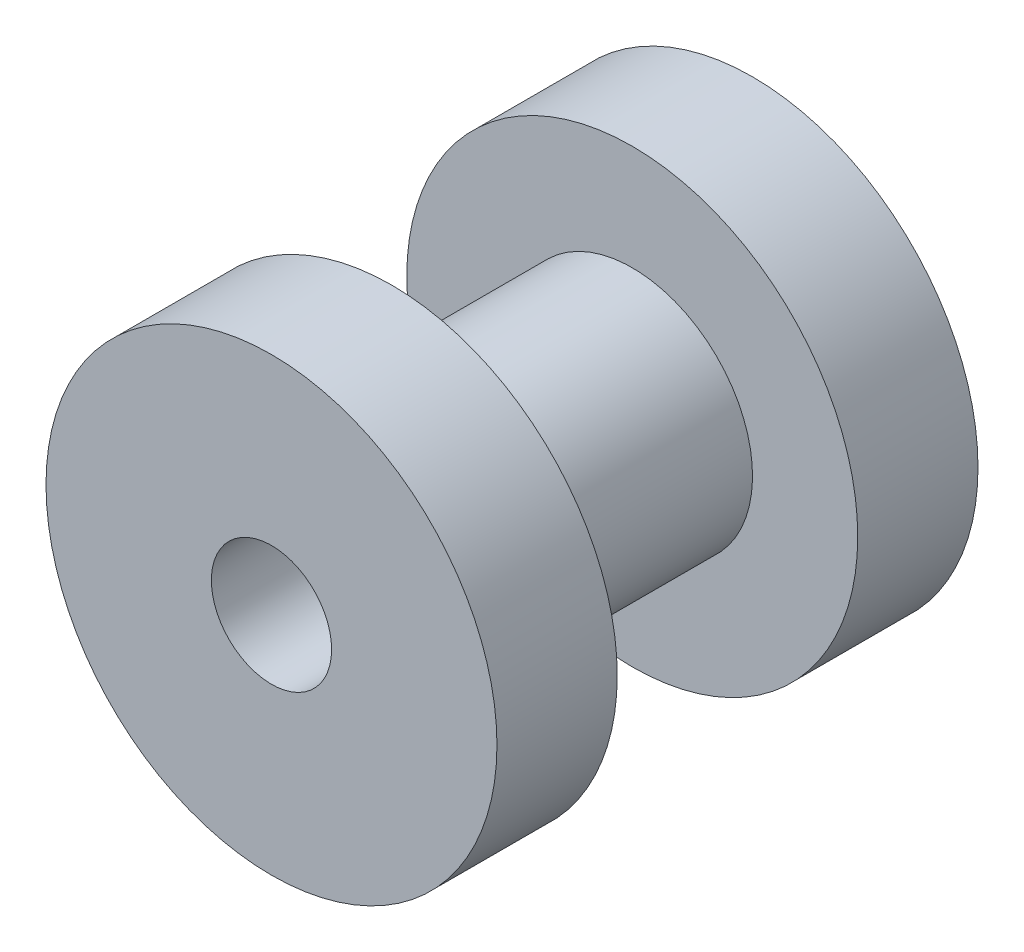
ISO-10303-21;
HEADER;
FILE_DESCRIPTION(('STEP AP214'),'2;1');
FILE_NAME('part.step','',(''),(''),'','','');
FILE_SCHEMA(('AUTOMOTIVE_DESIGN { 1 0 10303 214 1 1 1 1 }'));
ENDSEC;
DATA;
#1=APPLICATION_CONTEXT('core data for automotive mechanical design processes');
#2=APPLICATION_PROTOCOL_DEFINITION('international standard','automotive_design',2000,#1);
#3=PRODUCT_CONTEXT('',#1,'mechanical');
#4=PRODUCT('Part','Part','',(#3));
#5=PRODUCT_RELATED_PRODUCT_CATEGORY('part','',(#4));
#6=PRODUCT_DEFINITION_FORMATION('','',#4);
#7=PRODUCT_DEFINITION_CONTEXT('part definition',#1,'design');
#8=PRODUCT_DEFINITION('design','',#6,#7);
#9=PRODUCT_DEFINITION_SHAPE('','',#8);
#10=(LENGTH_UNIT() NAMED_UNIT(*) SI_UNIT(.MILLI.,.METRE.));
#11=(NAMED_UNIT(*) PLANE_ANGLE_UNIT() SI_UNIT($,.RADIAN.));
#12=(NAMED_UNIT(*) SI_UNIT($,.STERADIAN.) SOLID_ANGLE_UNIT());
#13=UNCERTAINTY_MEASURE_WITH_UNIT(LENGTH_MEASURE(1.E-05),#10,'distance_accuracy_value','');
#14=(GEOMETRIC_REPRESENTATION_CONTEXT(3) GLOBAL_UNCERTAINTY_ASSIGNED_CONTEXT((#13)) GLOBAL_UNIT_ASSIGNED_CONTEXT((#10,
#11,#12)) REPRESENTATION_CONTEXT('',''));
#15=CARTESIAN_POINT('',(0.,0.,0.));
#16=DIRECTION('',(0.,0.,1.));
#17=DIRECTION('',(1.,0.,0.));
#18=AXIS2_PLACEMENT_3D('',#15,#16,#17);
#19=CARTESIAN_POINT('',(0.,0.,5.08));
#20=DIRECTION('',(0.,0.,-1.));
#21=DIRECTION('',(-1.,0.,0.));
#22=AXIS2_PLACEMENT_3D('',#19,#20,#21);
#23=CYLINDRICAL_SURFACE('',#22,4.7625);
#24=CARTESIAN_POINT('',(0.,0.,-5.08));
#25=DIRECTION('',(0.,0.,1.));
#26=DIRECTION('',(1.,0.,0.));
#27=AXIS2_PLACEMENT_3D('',#24,#25,#26);
#28=CIRCLE('',#27,4.7625);
#29=CARTESIAN_POINT('',(4.7625,0.,-5.08));
#30=VERTEX_POINT('',#29);
#31=EDGE_CURVE('E38',#30,#30,#28,.T.);
#32=ORIENTED_EDGE('',*,*,#31,.T.);
#33=EDGE_LOOP('',(#32));
#34=FACE_BOUND('',#33,.T.);
#35=CARTESIAN_POINT('',(0.,0.,-2.54));
#36=DIRECTION('',(0.,0.,1.));
#37=DIRECTION('',(0.,-1.,0.));
#38=AXIS2_PLACEMENT_3D('',#35,#36,#37);
#39=CIRCLE('',#38,4.7625);
#40=CARTESIAN_POINT('',(0.,-4.7625,-2.54));
#41=VERTEX_POINT('',#40);
#42=EDGE_CURVE('E43',#41,#41,#39,.T.);
#43=ORIENTED_EDGE('',*,*,#42,.F.);
#44=EDGE_LOOP('',(#43));
#45=FACE_BOUND('',#44,.T.);
#46=ADVANCED_FACE('F31',(#34,#45),#23,.T.);
#47=CARTESIAN_POINT('',(0.,0.,-5.08));
#48=DIRECTION('',(0.,0.,1.));
#49=DIRECTION('',(1.,0.,0.));
#50=AXIS2_PLACEMENT_3D('',#47,#48,#49);
#51=PLANE('',#50);
#52=CARTESIAN_POINT('',(0.,0.,-5.08));
#53=DIRECTION('',(0.,0.,1.));
#54=DIRECTION('',(1.,0.,0.));
#55=AXIS2_PLACEMENT_3D('',#52,#53,#54);
#56=CIRCLE('',#55,1.27);
#57=CARTESIAN_POINT('',(1.27,0.,-5.08));
#58=VERTEX_POINT('',#57);
#59=EDGE_CURVE('E99',#58,#58,#56,.T.);
#60=ORIENTED_EDGE('',*,*,#59,.T.);
#61=EDGE_LOOP('',(#60));
#62=FACE_BOUND('',#61,.T.);
#63=ORIENTED_EDGE('',*,*,#31,.F.);
#64=EDGE_LOOP('',(#63));
#65=FACE_BOUND('',#64,.T.);
#66=ADVANCED_FACE('F57',(#62,#65),#51,.F.);
#67=CARTESIAN_POINT('',(0.,6.985,-2.54));
#68=DIRECTION('',(0.,0.,1.));
#69=DIRECTION('',(0.,-1.,0.));
#70=AXIS2_PLACEMENT_3D('',#67,#68,#69);
#71=PLANE('',#70);
#72=CARTESIAN_POINT('',(0.,0.,-2.54));
#73=DIRECTION('',(0.,0.,1.));
#74=DIRECTION('',(0.,-1.,0.));
#75=AXIS2_PLACEMENT_3D('',#72,#73,#74);
#76=CIRCLE('',#75,2.54);
#77=CARTESIAN_POINT('',(0.,-2.54,-2.54));
#78=VERTEX_POINT('',#77);
#79=EDGE_CURVE('E95',#78,#78,#76,.T.);
#80=ORIENTED_EDGE('',*,*,#79,.F.);
#81=EDGE_LOOP('',(#80));
#82=FACE_BOUND('',#81,.T.);
#83=ORIENTED_EDGE('',*,*,#42,.T.);
#84=EDGE_LOOP('',(#83));
#85=FACE_BOUND('',#84,.T.);
#86=ADVANCED_FACE('F54',(#82,#85),#71,.T.);
#87=CARTESIAN_POINT('',(0.,6.985,2.54));
#88=DIRECTION('',(0.,0.,-1.));
#89=DIRECTION('',(0.,1.,0.));
#90=AXIS2_PLACEMENT_3D('',#87,#88,#89);
#91=PLANE('',#90);
#92=CARTESIAN_POINT('',(0.,0.,2.54));
#93=DIRECTION('',(0.,0.,1.));
#94=DIRECTION('',(0.,-1.,0.));
#95=AXIS2_PLACEMENT_3D('',#92,#93,#94);
#96=CIRCLE('',#95,2.54);
#97=CARTESIAN_POINT('',(0.,-2.54,2.54));
#98=VERTEX_POINT('',#97);
#99=EDGE_CURVE('E46',#98,#98,#96,.T.);
#100=ORIENTED_EDGE('',*,*,#99,.T.);
#101=EDGE_LOOP('',(#100));
#102=FACE_BOUND('',#101,.T.);
#103=CARTESIAN_POINT('',(0.,0.,2.54));
#104=DIRECTION('',(0.,0.,-1.));
#105=DIRECTION('',(0.,1.,0.));
#106=AXIS2_PLACEMENT_3D('',#103,#104,#105);
#107=CIRCLE('',#106,4.7625);
#108=CARTESIAN_POINT('',(0.,4.7625,2.54));
#109=VERTEX_POINT('',#108);
#110=EDGE_CURVE('E49',#109,#109,#107,.T.);
#111=ORIENTED_EDGE('',*,*,#110,.T.);
#112=EDGE_LOOP('',(#111));
#113=FACE_BOUND('',#112,.T.);
#114=ADVANCED_FACE('F80',(#102,#113),#91,.T.);
#115=CARTESIAN_POINT('',(0.,0.,0.));
#116=DIRECTION('',(0.,0.,1.));
#117=DIRECTION('',(0.,-1.,0.));
#118=AXIS2_PLACEMENT_3D('',#115,#116,#117);
#119=CYLINDRICAL_SURFACE('',#118,2.54);
#120=ORIENTED_EDGE('',*,*,#79,.T.);
#121=EDGE_LOOP('',(#120));
#122=FACE_BOUND('',#121,.T.);
#123=ORIENTED_EDGE('',*,*,#99,.F.);
#124=EDGE_LOOP('',(#123));
#125=FACE_BOUND('',#124,.T.);
#126=ADVANCED_FACE('F74',(#122,#125),#119,.T.);
#127=CARTESIAN_POINT('',(0.,0.,5.08));
#128=DIRECTION('',(0.,0.,1.));
#129=DIRECTION('',(1.,0.,0.));
#130=AXIS2_PLACEMENT_3D('',#127,#128,#129);
#131=PLANE('',#130);
#132=CARTESIAN_POINT('',(0.,0.,5.08));
#133=DIRECTION('',(0.,0.,1.));
#134=DIRECTION('',(1.,0.,0.));
#135=AXIS2_PLACEMENT_3D('',#132,#133,#134);
#136=CIRCLE('',#135,1.27);
#137=CARTESIAN_POINT('',(1.27,0.,5.08));
#138=VERTEX_POINT('',#137);
#139=EDGE_CURVE('E34',#138,#138,#136,.T.);
#140=ORIENTED_EDGE('',*,*,#139,.F.);
#141=EDGE_LOOP('',(#140));
#142=FACE_BOUND('',#141,.T.);
#143=CARTESIAN_POINT('',(0.,0.,5.08));
#144=DIRECTION('',(0.,0.,1.));
#145=DIRECTION('',(1.,0.,0.));
#146=AXIS2_PLACEMENT_3D('',#143,#144,#145);
#147=CIRCLE('',#146,4.7625);
#148=CARTESIAN_POINT('',(4.7625,0.,5.08));
#149=VERTEX_POINT('',#148);
#150=EDGE_CURVE('E10',#149,#149,#147,.T.);
#151=ORIENTED_EDGE('',*,*,#150,.T.);
#152=EDGE_LOOP('',(#151));
#153=FACE_BOUND('',#152,.T.);
#154=ADVANCED_FACE('F66',(#142,#153),#131,.T.);
#155=ORIENTED_EDGE('',*,*,#150,.F.);
#156=EDGE_LOOP('',(#155));
#157=FACE_BOUND('',#156,.T.);
#158=ORIENTED_EDGE('',*,*,#110,.F.);
#159=EDGE_LOOP('',(#158));
#160=FACE_BOUND('',#159,.T.);
#161=ADVANCED_FACE('F59',(#157,#160),#23,.T.);
#162=CARTESIAN_POINT('',(0.,0.,-5.08));
#163=DIRECTION('',(0.,0.,1.));
#164=DIRECTION('',(1.,0.,0.));
#165=AXIS2_PLACEMENT_3D('',#162,#163,#164);
#166=CYLINDRICAL_SURFACE('',#165,1.27);
#167=ORIENTED_EDGE('',*,*,#139,.T.);
#168=EDGE_LOOP('',(#167));
#169=FACE_BOUND('',#168,.T.);
#170=ORIENTED_EDGE('',*,*,#59,.F.);
#171=EDGE_LOOP('',(#170));
#172=FACE_BOUND('',#171,.T.);
#173=ADVANCED_FACE('F65',(#169,#172),#166,.F.);
#174=CLOSED_SHELL('',(#46,#66,#86,#114,#126,#154,#161,#173));
#175=MANIFOLD_SOLID_BREP('B2',#174);
#176=ADVANCED_BREP_SHAPE_REPRESENTATION('',(#18,#175),#14);
#177=SHAPE_DEFINITION_REPRESENTATION(#9,#176);
ENDSEC;
END-ISO-10303-21;
